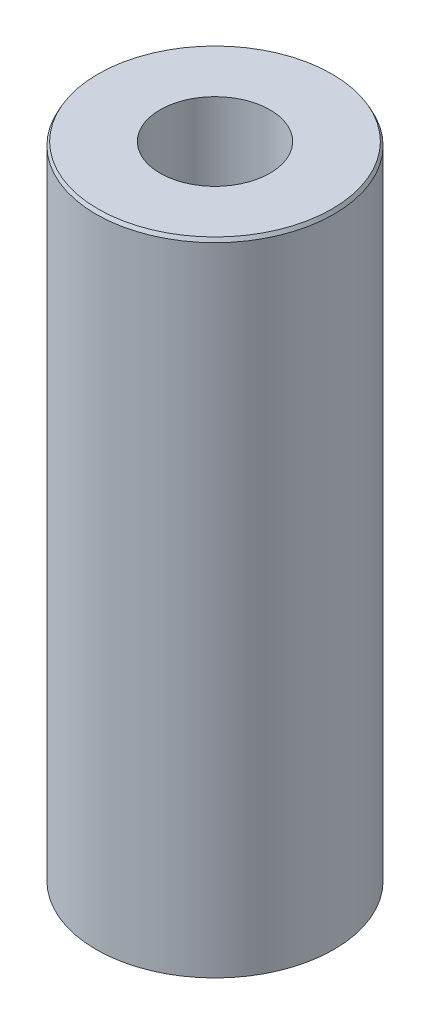
ISO-10303-21;
HEADER;
FILE_DESCRIPTION(('STEP AP214'),'2;1');
FILE_NAME('part.step','',(''),(''),'','','');
FILE_SCHEMA(('AUTOMOTIVE_DESIGN { 1 0 10303 214 1 1 1 1 }'));
ENDSEC;
DATA;
#1=APPLICATION_CONTEXT('core data for automotive mechanical design processes');
#2=APPLICATION_PROTOCOL_DEFINITION('international standard','automotive_design',2000,#1);
#3=PRODUCT_CONTEXT('',#1,'mechanical');
#4=PRODUCT('Part','Part','',(#3));
#5=PRODUCT_RELATED_PRODUCT_CATEGORY('part','',(#4));
#6=PRODUCT_DEFINITION_FORMATION('','',#4);
#7=PRODUCT_DEFINITION_CONTEXT('part definition',#1,'design');
#8=PRODUCT_DEFINITION('design','',#6,#7);
#9=PRODUCT_DEFINITION_SHAPE('','',#8);
#10=(LENGTH_UNIT() NAMED_UNIT(*) SI_UNIT(.MILLI.,.METRE.));
#11=(NAMED_UNIT(*) PLANE_ANGLE_UNIT() SI_UNIT($,.RADIAN.));
#12=(NAMED_UNIT(*) SI_UNIT($,.STERADIAN.) SOLID_ANGLE_UNIT());
#13=UNCERTAINTY_MEASURE_WITH_UNIT(LENGTH_MEASURE(1.E-05),#10,'distance_accuracy_value','');
#14=(GEOMETRIC_REPRESENTATION_CONTEXT(3) GLOBAL_UNCERTAINTY_ASSIGNED_CONTEXT((#13)) GLOBAL_UNIT_ASSIGNED_CONTEXT((#10,
#11,#12)) REPRESENTATION_CONTEXT('',''));
#15=CARTESIAN_POINT('',(0.,0.,0.));
#16=DIRECTION('',(0.,0.,1.));
#17=DIRECTION('',(1.,0.,0.));
#18=AXIS2_PLACEMENT_3D('',#15,#16,#17);
#19=CARTESIAN_POINT('',(0.,148.589181166692,0.));
#20=DIRECTION('',(0.,-1.,0.));
#21=DIRECTION('',(0.,0.,-1.));
#22=AXIS2_PLACEMENT_3D('',#19,#20,#21);
#23=CYLINDRICAL_SURFACE('',#22,27.5);
#24=CARTESIAN_POINT('',(0.,147.757632821466,0.));
#25=DIRECTION('',(0.,1.,0.));
#26=DIRECTION('',(0.,0.,1.));
#27=AXIS2_PLACEMENT_3D('',#24,#25,#26);
#28=CIRCLE('',#27,27.5);
#29=CARTESIAN_POINT('',(0.,147.757632821466,27.5));
#30=VERTEX_POINT('',#29);
#31=EDGE_CURVE('E50',#30,#30,#28,.F.);
#32=ORIENTED_EDGE('',*,*,#31,.T.);
#33=EDGE_LOOP('',(#32));
#34=FACE_BOUND('',#33,.T.);
#35=CARTESIAN_POINT('',(0.,0.443385723529477,0.));
#36=DIRECTION('',(0.,1.,0.));
#37=DIRECTION('',(0.,0.,1.));
#38=AXIS2_PLACEMENT_3D('',#35,#36,#37);
#39=CIRCLE('',#38,27.5);
#40=CARTESIAN_POINT('',(0.,0.443385723529477,27.5));
#41=VERTEX_POINT('',#40);
#42=EDGE_CURVE('E51',#41,#41,#39,.T.);
#43=ORIENTED_EDGE('',*,*,#42,.T.);
#44=EDGE_LOOP('',(#43));
#45=FACE_BOUND('',#44,.T.);
#46=ADVANCED_FACE('F39',(#34,#45),#23,.T.);
#47=CARTESIAN_POINT('',(0.,148.589181166692,0.));
#48=DIRECTION('',(0.,1.,0.));
#49=DIRECTION('',(0.,0.,1.));
#50=AXIS2_PLACEMENT_3D('',#47,#48,#49);
#51=PLANE('',#50);
#52=CARTESIAN_POINT('',(0.,148.589181166692,0.));
#53=DIRECTION('',(0.,1.,0.));
#54=DIRECTION('',(0.,0.,1.));
#55=AXIS2_PLACEMENT_3D('',#52,#53,#54);
#56=CIRCLE('',#55,27.0566142764705);
#57=CARTESIAN_POINT('',(0.,148.589181166692,27.0566142764705));
#58=VERTEX_POINT('',#57);
#59=EDGE_CURVE('E54',#58,#58,#56,.T.);
#60=ORIENTED_EDGE('',*,*,#59,.T.);
#61=EDGE_LOOP('',(#60));
#62=FACE_BOUND('',#61,.T.);
#63=CARTESIAN_POINT('',(0.,148.589181166692,0.));
#64=DIRECTION('',(0.,1.,0.));
#65=DIRECTION('',(0.,0.,1.));
#66=AXIS2_PLACEMENT_3D('',#63,#64,#65);
#67=CIRCLE('',#66,12.7159996433697);
#68=CARTESIAN_POINT('',(0.,148.589181166692,12.7159996433697));
#69=VERTEX_POINT('',#68);
#70=EDGE_CURVE('E58',#69,#69,#67,.T.);
#71=ORIENTED_EDGE('',*,*,#70,.F.);
#72=EDGE_LOOP('',(#71));
#73=FACE_BOUND('',#72,.T.);
#74=ADVANCED_FACE('F69',(#62,#73),#51,.T.);
#75=CARTESIAN_POINT('',(0.,0.,0.));
#76=DIRECTION('',(0.,1.,0.));
#77=DIRECTION('',(0.,0.,1.));
#78=AXIS2_PLACEMENT_3D('',#75,#76,#77);
#79=PLANE('',#78);
#80=CARTESIAN_POINT('',(0.,0.,0.));
#81=DIRECTION('',(0.,1.,0.));
#82=DIRECTION('',(0.,0.,1.));
#83=AXIS2_PLACEMENT_3D('',#80,#81,#82);
#84=CIRCLE('',#83,26.6684516547743);
#85=CARTESIAN_POINT('',(0.,0.,26.6684516547743));
#86=VERTEX_POINT('',#85);
#87=EDGE_CURVE('E10',#86,#86,#84,.F.);
#88=ORIENTED_EDGE('',*,*,#87,.T.);
#89=EDGE_LOOP('',(#88));
#90=FACE_BOUND('',#89,.T.);
#91=CARTESIAN_POINT('',(0.,0.,0.));
#92=DIRECTION('',(0.,1.,0.));
#93=DIRECTION('',(0.,0.,1.));
#94=AXIS2_PLACEMENT_3D('',#91,#92,#93);
#95=CIRCLE('',#94,12.7159996433697);
#96=CARTESIAN_POINT('',(0.,0.,12.7159996433697));
#97=VERTEX_POINT('',#96);
#98=EDGE_CURVE('E63',#97,#97,#95,.T.);
#99=ORIENTED_EDGE('',*,*,#98,.T.);
#100=EDGE_LOOP('',(#99));
#101=FACE_BOUND('',#100,.T.);
#102=ADVANCED_FACE('F75',(#90,#101),#79,.F.);
#103=CARTESIAN_POINT('',(0.,148.589181166692,0.));
#104=DIRECTION('',(0.,-1.,0.));
#105=DIRECTION('',(0.,0.,-1.));
#106=AXIS2_PLACEMENT_3D('',#103,#104,#105);
#107=CYLINDRICAL_SURFACE('',#106,12.7159996433697);
#108=ORIENTED_EDGE('',*,*,#70,.T.);
#109=EDGE_LOOP('',(#108));
#110=FACE_BOUND('',#109,.T.);
#111=ORIENTED_EDGE('',*,*,#98,.F.);
#112=EDGE_LOOP('',(#111));
#113=FACE_BOUND('',#112,.T.);
#114=ADVANCED_FACE('F70',(#110,#113),#107,.F.);
#115=CARTESIAN_POINT('',(0.,148.589181166692,0.));
#116=DIRECTION('',(0.,-1.,0.));
#117=DIRECTION('',(0.,0.,-1.));
#118=AXIS2_PLACEMENT_3D('',#115,#116,#117);
#119=CONICAL_SURFACE('',#118,27.0566142764705,0.489857396304707);
#120=ORIENTED_EDGE('',*,*,#31,.F.);
#121=EDGE_LOOP('',(#120));
#122=FACE_BOUND('',#121,.T.);
#123=ORIENTED_EDGE('',*,*,#59,.F.);
#124=EDGE_LOOP('',(#123));
#125=FACE_BOUND('',#124,.T.);
#126=ADVANCED_FACE('F81',(#122,#125),#119,.T.);
#127=CARTESIAN_POINT('',(0.,0.443385723529477,0.));
#128=DIRECTION('',(0.,1.,0.));
#129=DIRECTION('',(0.,0.,1.));
#130=AXIS2_PLACEMENT_3D('',#127,#128,#129);
#131=CONICAL_SURFACE('',#130,27.5,1.08093893049017);
#132=ORIENTED_EDGE('',*,*,#87,.F.);
#133=EDGE_LOOP('',(#132));
#134=FACE_BOUND('',#133,.T.);
#135=ORIENTED_EDGE('',*,*,#42,.F.);
#136=EDGE_LOOP('',(#135));
#137=FACE_BOUND('',#136,.T.);
#138=ADVANCED_FACE('F45',(#134,#137),#131,.T.);
#139=CLOSED_SHELL('',(#46,#74,#102,#114,#126,#138));
#140=MANIFOLD_SOLID_BREP('B2',#139);
#141=ADVANCED_BREP_SHAPE_REPRESENTATION('',(#18,#140),#14);
#142=SHAPE_DEFINITION_REPRESENTATION(#9,#141);
ENDSEC;
END-ISO-10303-21;
